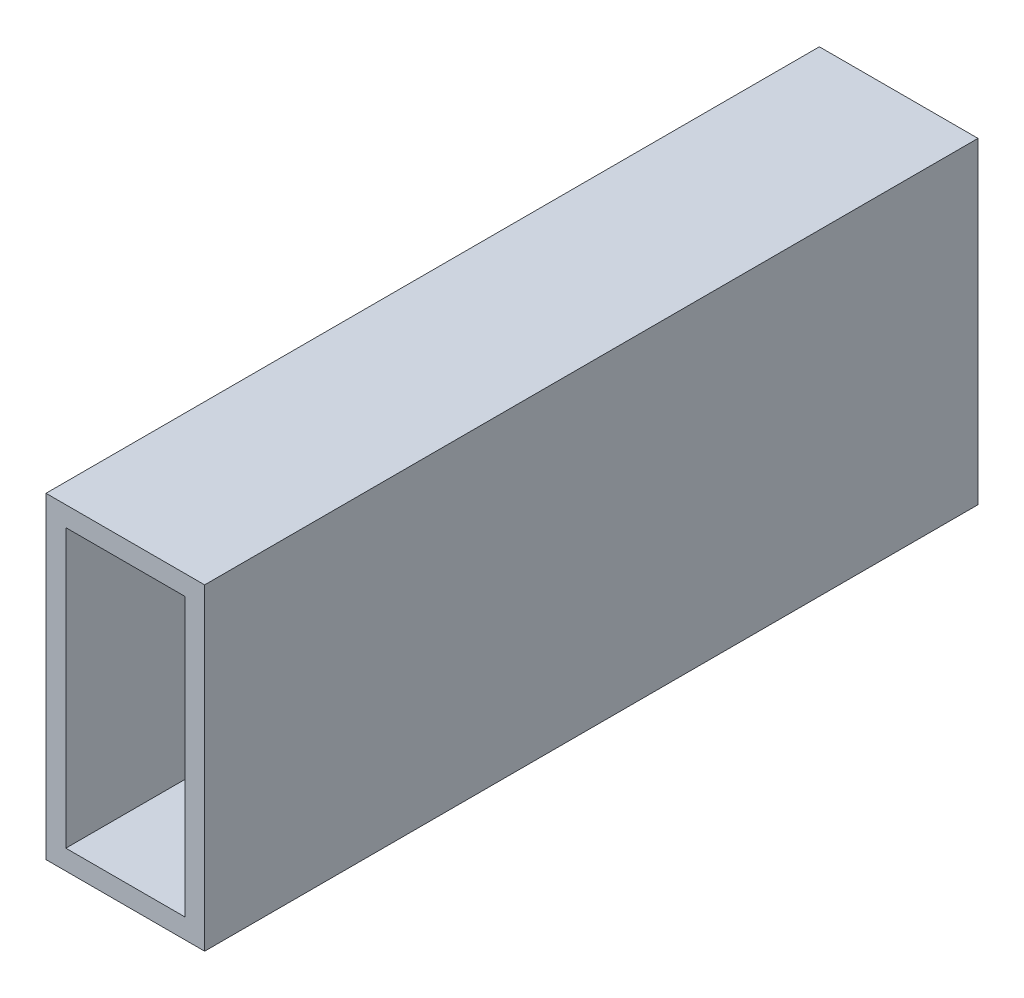
ISO-10303-21;
HEADER;
FILE_DESCRIPTION(('STEP AP214'),'2;1');
FILE_NAME('part.step','',(''),(''),'','','');
FILE_SCHEMA(('AUTOMOTIVE_DESIGN { 1 0 10303 214 1 1 1 1 }'));
ENDSEC;
DATA;
#1=APPLICATION_CONTEXT('core data for automotive mechanical design processes');
#2=APPLICATION_PROTOCOL_DEFINITION('international standard','automotive_design',2000,#1);
#3=PRODUCT_CONTEXT('',#1,'mechanical');
#4=PRODUCT('Part','Part','',(#3));
#5=PRODUCT_RELATED_PRODUCT_CATEGORY('part','',(#4));
#6=PRODUCT_DEFINITION_FORMATION('','',#4);
#7=PRODUCT_DEFINITION_CONTEXT('part definition',#1,'design');
#8=PRODUCT_DEFINITION('design','',#6,#7);
#9=PRODUCT_DEFINITION_SHAPE('','',#8);
#10=(LENGTH_UNIT() NAMED_UNIT(*) SI_UNIT(.MILLI.,.METRE.));
#11=(NAMED_UNIT(*) PLANE_ANGLE_UNIT() SI_UNIT($,.RADIAN.));
#12=(NAMED_UNIT(*) SI_UNIT($,.STERADIAN.) SOLID_ANGLE_UNIT());
#13=UNCERTAINTY_MEASURE_WITH_UNIT(LENGTH_MEASURE(1.E-05),#10,'distance_accuracy_value','');
#14=(GEOMETRIC_REPRESENTATION_CONTEXT(3) GLOBAL_UNCERTAINTY_ASSIGNED_CONTEXT((#13)) GLOBAL_UNIT_ASSIGNED_CONTEXT((#10,
#11,#12)) REPRESENTATION_CONTEXT('',''));
#15=CARTESIAN_POINT('',(0.,0.,0.));
#16=DIRECTION('',(0.,0.,1.));
#17=DIRECTION('',(1.,0.,0.));
#18=AXIS2_PLACEMENT_3D('',#15,#16,#17);
#19=CARTESIAN_POINT('',(0.,0.,61.9125));
#20=DIRECTION('',(0.,0.,-1.));
#21=DIRECTION('',(-1.,0.,0.));
#22=AXIS2_PLACEMENT_3D('',#19,#20,#21);
#23=PLANE('',#22);
#24=DIRECTION('',(0.,1.,0.));
#25=VECTOR('',#24,1.);
#26=CARTESIAN_POINT('',(12.7,-25.4,61.9125));
#27=LINE('',#26,#25);
#28=CARTESIAN_POINT('',(12.7,-25.4,61.9125));
#29=VERTEX_POINT('',#28);
#30=CARTESIAN_POINT('',(12.7,25.4,61.9125));
#31=VERTEX_POINT('',#30);
#32=EDGE_CURVE('E130',#29,#31,#27,.T.);
#33=ORIENTED_EDGE('',*,*,#32,.T.);
#34=DIRECTION('',(-1.,0.,0.));
#35=VECTOR('',#34,1.);
#36=CARTESIAN_POINT('',(-12.7,25.4,61.9125));
#37=LINE('',#36,#35);
#38=CARTESIAN_POINT('',(-12.7,25.4,61.9125));
#39=VERTEX_POINT('',#38);
#40=EDGE_CURVE('E133',#31,#39,#37,.T.);
#41=ORIENTED_EDGE('',*,*,#40,.T.);
#42=DIRECTION('',(0.,-1.,0.));
#43=VECTOR('',#42,1.);
#44=CARTESIAN_POINT('',(-12.7,-25.4,61.9125));
#45=LINE('',#44,#43);
#46=CARTESIAN_POINT('',(-12.7,-25.4,61.9125));
#47=VERTEX_POINT('',#46);
#48=EDGE_CURVE('E136',#39,#47,#45,.T.);
#49=ORIENTED_EDGE('',*,*,#48,.T.);
#50=DIRECTION('',(1.,0.,0.));
#51=VECTOR('',#50,1.);
#52=CARTESIAN_POINT('',(-12.7,-25.4,61.9125));
#53=LINE('',#52,#51);
#54=EDGE_CURVE('E138',#47,#29,#53,.T.);
#55=ORIENTED_EDGE('',*,*,#54,.T.);
#56=EDGE_LOOP('',(#33,#41,#49,#55));
#57=FACE_BOUND('',#56,.T.);
#58=DIRECTION('',(0.,1.,0.));
#59=VECTOR('',#58,1.);
#60=CARTESIAN_POINT('',(9.525,0.,61.9125));
#61=LINE('',#60,#59);
#62=CARTESIAN_POINT('',(9.525,-22.225,61.9125));
#63=VERTEX_POINT('',#62);
#64=CARTESIAN_POINT('',(9.525,22.225,61.9125));
#65=VERTEX_POINT('',#64);
#66=EDGE_CURVE('E118',#63,#65,#61,.T.);
#67=ORIENTED_EDGE('',*,*,#66,.F.);
#68=DIRECTION('',(1.,0.,0.));
#69=VECTOR('',#68,1.);
#70=CARTESIAN_POINT('',(0.,-22.225,61.9125));
#71=LINE('',#70,#69);
#72=CARTESIAN_POINT('',(-9.525,-22.225,61.9125));
#73=VERTEX_POINT('',#72);
#74=EDGE_CURVE('E103',#73,#63,#71,.T.);
#75=ORIENTED_EDGE('',*,*,#74,.F.);
#76=DIRECTION('',(0.,-1.,0.));
#77=VECTOR('',#76,1.);
#78=CARTESIAN_POINT('',(-9.525,0.,61.9125));
#79=LINE('',#78,#77);
#80=CARTESIAN_POINT('',(-9.525,22.225,61.9125));
#81=VERTEX_POINT('',#80);
#82=EDGE_CURVE('E127',#81,#73,#79,.T.);
#83=ORIENTED_EDGE('',*,*,#82,.F.);
#84=DIRECTION('',(-1.,0.,0.));
#85=VECTOR('',#84,1.);
#86=CARTESIAN_POINT('',(0.,22.225,61.9125));
#87=LINE('',#86,#85);
#88=EDGE_CURVE('E120',#65,#81,#87,.T.);
#89=ORIENTED_EDGE('',*,*,#88,.F.);
#90=EDGE_LOOP('',(#67,#75,#83,#89));
#91=FACE_BOUND('',#90,.T.);
#92=ADVANCED_FACE('F33',(#57,#91),#23,.F.);
#93=CARTESIAN_POINT('',(0.,0.,-61.9125));
#94=DIRECTION('',(0.,0.,-1.));
#95=DIRECTION('',(-1.,0.,0.));
#96=AXIS2_PLACEMENT_3D('',#93,#94,#95);
#97=PLANE('',#96);
#98=DIRECTION('',(0.,1.,0.));
#99=VECTOR('',#98,1.);
#100=CARTESIAN_POINT('',(12.7,-25.4,-61.9125));
#101=LINE('',#100,#99);
#102=CARTESIAN_POINT('',(12.7,-25.4,-61.9125));
#103=VERTEX_POINT('',#102);
#104=CARTESIAN_POINT('',(12.7,25.4,-61.9125));
#105=VERTEX_POINT('',#104);
#106=EDGE_CURVE('E141',#103,#105,#101,.T.);
#107=ORIENTED_EDGE('',*,*,#106,.F.);
#108=DIRECTION('',(1.,0.,0.));
#109=VECTOR('',#108,1.);
#110=CARTESIAN_POINT('',(-12.7,-25.4,-61.9125));
#111=LINE('',#110,#109);
#112=CARTESIAN_POINT('',(-12.7,-25.4,-61.9125));
#113=VERTEX_POINT('',#112);
#114=EDGE_CURVE('E134',#113,#103,#111,.T.);
#115=ORIENTED_EDGE('',*,*,#114,.F.);
#116=DIRECTION('',(0.,-1.,0.));
#117=VECTOR('',#116,1.);
#118=CARTESIAN_POINT('',(-12.7,-25.4,-61.9125));
#119=LINE('',#118,#117);
#120=CARTESIAN_POINT('',(-12.7,25.4,-61.9125));
#121=VERTEX_POINT('',#120);
#122=EDGE_CURVE('E146',#121,#113,#119,.T.);
#123=ORIENTED_EDGE('',*,*,#122,.F.);
#124=DIRECTION('',(-1.,0.,0.));
#125=VECTOR('',#124,1.);
#126=CARTESIAN_POINT('',(-12.7,25.4,-61.9125));
#127=LINE('',#126,#125);
#128=EDGE_CURVE('E144',#105,#121,#127,.T.);
#129=ORIENTED_EDGE('',*,*,#128,.F.);
#130=EDGE_LOOP('',(#107,#115,#123,#129));
#131=FACE_BOUND('',#130,.T.);
#132=DIRECTION('',(1.,0.,0.));
#133=VECTOR('',#132,1.);
#134=CARTESIAN_POINT('',(0.,-22.225,-61.9125));
#135=LINE('',#134,#133);
#136=CARTESIAN_POINT('',(-9.525,-22.225,-61.9125));
#137=VERTEX_POINT('',#136);
#138=CARTESIAN_POINT('',(9.525,-22.225,-61.9125));
#139=VERTEX_POINT('',#138);
#140=EDGE_CURVE('E101',#137,#139,#135,.T.);
#141=ORIENTED_EDGE('',*,*,#140,.T.);
#142=DIRECTION('',(0.,1.,0.));
#143=VECTOR('',#142,1.);
#144=CARTESIAN_POINT('',(9.525,0.,-61.9125));
#145=LINE('',#144,#143);
#146=CARTESIAN_POINT('',(9.525,22.225,-61.9125));
#147=VERTEX_POINT('',#146);
#148=EDGE_CURVE('E109',#139,#147,#145,.T.);
#149=ORIENTED_EDGE('',*,*,#148,.T.);
#150=DIRECTION('',(-1.,0.,0.));
#151=VECTOR('',#150,1.);
#152=CARTESIAN_POINT('',(0.,22.225,-61.9125));
#153=LINE('',#152,#151);
#154=CARTESIAN_POINT('',(-9.525,22.225,-61.9125));
#155=VERTEX_POINT('',#154);
#156=EDGE_CURVE('E115',#147,#155,#153,.T.);
#157=ORIENTED_EDGE('',*,*,#156,.T.);
#158=DIRECTION('',(0.,-1.,0.));
#159=VECTOR('',#158,1.);
#160=CARTESIAN_POINT('',(-9.525,0.,-61.9125));
#161=LINE('',#160,#159);
#162=EDGE_CURVE('E55',#155,#137,#161,.T.);
#163=ORIENTED_EDGE('',*,*,#162,.T.);
#164=EDGE_LOOP('',(#141,#149,#157,#163));
#165=FACE_BOUND('',#164,.T.);
#166=ADVANCED_FACE('F117',(#131,#165),#97,.T.);
#167=CARTESIAN_POINT('',(12.7,-25.4,61.9125));
#168=DIRECTION('',(-1.,0.,0.));
#169=DIRECTION('',(0.,0.,1.));
#170=AXIS2_PLACEMENT_3D('',#167,#168,#169);
#171=PLANE('',#170);
#172=ORIENTED_EDGE('',*,*,#106,.T.);
#173=DIRECTION('',(0.,0.,-1.));
#174=VECTOR('',#173,1.);
#175=CARTESIAN_POINT('',(12.7,25.4,61.9125));
#176=LINE('',#175,#174);
#177=EDGE_CURVE('E11',#31,#105,#176,.T.);
#178=ORIENTED_EDGE('',*,*,#177,.F.);
#179=ORIENTED_EDGE('',*,*,#32,.F.);
#180=DIRECTION('',(0.,0.,-1.));
#181=VECTOR('',#180,1.);
#182=CARTESIAN_POINT('',(12.7,-25.4,61.9125));
#183=LINE('',#182,#181);
#184=EDGE_CURVE('E140',#29,#103,#183,.T.);
#185=ORIENTED_EDGE('',*,*,#184,.T.);
#186=EDGE_LOOP('',(#172,#178,#179,#185));
#187=FACE_BOUND('',#186,.T.);
#188=ADVANCED_FACE('F35',(#187),#171,.F.);
#189=CARTESIAN_POINT('',(-12.7,25.4,61.9125));
#190=DIRECTION('',(0.,-1.,0.));
#191=DIRECTION('',(0.,0.,-1.));
#192=AXIS2_PLACEMENT_3D('',#189,#190,#191);
#193=PLANE('',#192);
#194=ORIENTED_EDGE('',*,*,#128,.T.);
#195=DIRECTION('',(0.,0.,-1.));
#196=VECTOR('',#195,1.);
#197=CARTESIAN_POINT('',(-12.7,25.4,61.9125));
#198=LINE('',#197,#196);
#199=EDGE_CURVE('E41',#39,#121,#198,.T.);
#200=ORIENTED_EDGE('',*,*,#199,.F.);
#201=ORIENTED_EDGE('',*,*,#40,.F.);
#202=ORIENTED_EDGE('',*,*,#177,.T.);
#203=EDGE_LOOP('',(#194,#200,#201,#202));
#204=FACE_BOUND('',#203,.T.);
#205=ADVANCED_FACE('F173',(#204),#193,.F.);
#206=CARTESIAN_POINT('',(-12.7,-25.4,61.9125));
#207=DIRECTION('',(1.,0.,0.));
#208=DIRECTION('',(0.,0.,-1.));
#209=AXIS2_PLACEMENT_3D('',#206,#207,#208);
#210=PLANE('',#209);
#211=ORIENTED_EDGE('',*,*,#122,.T.);
#212=DIRECTION('',(0.,0.,-1.));
#213=VECTOR('',#212,1.);
#214=CARTESIAN_POINT('',(-12.7,-25.4,61.9125));
#215=LINE('',#214,#213);
#216=EDGE_CURVE('E151',#47,#113,#215,.T.);
#217=ORIENTED_EDGE('',*,*,#216,.F.);
#218=ORIENTED_EDGE('',*,*,#48,.F.);
#219=ORIENTED_EDGE('',*,*,#199,.T.);
#220=EDGE_LOOP('',(#211,#217,#218,#219));
#221=FACE_BOUND('',#220,.T.);
#222=ADVANCED_FACE('F158',(#221),#210,.F.);
#223=CARTESIAN_POINT('',(-12.7,-25.4,61.9125));
#224=DIRECTION('',(0.,1.,0.));
#225=DIRECTION('',(0.,0.,1.));
#226=AXIS2_PLACEMENT_3D('',#223,#224,#225);
#227=PLANE('',#226);
#228=ORIENTED_EDGE('',*,*,#114,.T.);
#229=ORIENTED_EDGE('',*,*,#184,.F.);
#230=ORIENTED_EDGE('',*,*,#54,.F.);
#231=ORIENTED_EDGE('',*,*,#216,.T.);
#232=EDGE_LOOP('',(#228,#229,#230,#231));
#233=FACE_BOUND('',#232,.T.);
#234=ADVANCED_FACE('F166',(#233),#227,.F.);
#235=CARTESIAN_POINT('',(9.525,-25.4,61.9125));
#236=DIRECTION('',(-1.,0.,0.));
#237=DIRECTION('',(0.,0.,1.));
#238=AXIS2_PLACEMENT_3D('',#235,#236,#237);
#239=PLANE('',#238);
#240=ORIENTED_EDGE('',*,*,#148,.F.);
#241=DIRECTION('',(0.,0.,-1.));
#242=VECTOR('',#241,1.);
#243=CARTESIAN_POINT('',(9.525,-22.225,61.9125));
#244=LINE('',#243,#242);
#245=EDGE_CURVE('E97',#63,#139,#244,.T.);
#246=ORIENTED_EDGE('',*,*,#245,.F.);
#247=ORIENTED_EDGE('',*,*,#66,.T.);
#248=DIRECTION('',(0.,0.,-1.));
#249=VECTOR('',#248,1.);
#250=CARTESIAN_POINT('',(9.525,22.225,61.9125));
#251=LINE('',#250,#249);
#252=EDGE_CURVE('E112',#65,#147,#251,.T.);
#253=ORIENTED_EDGE('',*,*,#252,.T.);
#254=EDGE_LOOP('',(#240,#246,#247,#253));
#255=FACE_BOUND('',#254,.T.);
#256=ADVANCED_FACE('F110',(#255),#239,.T.);
#257=CARTESIAN_POINT('',(-12.7,22.225,61.9125));
#258=DIRECTION('',(0.,-1.,0.));
#259=DIRECTION('',(0.,0.,-1.));
#260=AXIS2_PLACEMENT_3D('',#257,#258,#259);
#261=PLANE('',#260);
#262=ORIENTED_EDGE('',*,*,#156,.F.);
#263=ORIENTED_EDGE('',*,*,#252,.F.);
#264=ORIENTED_EDGE('',*,*,#88,.T.);
#265=DIRECTION('',(0.,0.,-1.));
#266=VECTOR('',#265,1.);
#267=CARTESIAN_POINT('',(-9.525,22.225,61.9125));
#268=LINE('',#267,#266);
#269=EDGE_CURVE('E256',#81,#155,#268,.T.);
#270=ORIENTED_EDGE('',*,*,#269,.T.);
#271=EDGE_LOOP('',(#262,#263,#264,#270));
#272=FACE_BOUND('',#271,.T.);
#273=ADVANCED_FACE('F193',(#272),#261,.T.);
#274=CARTESIAN_POINT('',(-9.525,-25.4,61.9125));
#275=DIRECTION('',(1.,0.,0.));
#276=DIRECTION('',(0.,0.,-1.));
#277=AXIS2_PLACEMENT_3D('',#274,#275,#276);
#278=PLANE('',#277);
#279=ORIENTED_EDGE('',*,*,#162,.F.);
#280=ORIENTED_EDGE('',*,*,#269,.F.);
#281=ORIENTED_EDGE('',*,*,#82,.T.);
#282=DIRECTION('',(0.,0.,-1.));
#283=VECTOR('',#282,1.);
#284=CARTESIAN_POINT('',(-9.525,-22.225,61.9125));
#285=LINE('',#284,#283);
#286=EDGE_CURVE('E48',#73,#137,#285,.T.);
#287=ORIENTED_EDGE('',*,*,#286,.T.);
#288=EDGE_LOOP('',(#279,#280,#281,#287));
#289=FACE_BOUND('',#288,.T.);
#290=ADVANCED_FACE('F198',(#289),#278,.T.);
#291=CARTESIAN_POINT('',(-12.7,-22.225,61.9125));
#292=DIRECTION('',(0.,1.,0.));
#293=DIRECTION('',(0.,0.,1.));
#294=AXIS2_PLACEMENT_3D('',#291,#292,#293);
#295=PLANE('',#294);
#296=ORIENTED_EDGE('',*,*,#140,.F.);
#297=ORIENTED_EDGE('',*,*,#286,.F.);
#298=ORIENTED_EDGE('',*,*,#74,.T.);
#299=ORIENTED_EDGE('',*,*,#245,.T.);
#300=EDGE_LOOP('',(#296,#297,#298,#299));
#301=FACE_BOUND('',#300,.T.);
#302=ADVANCED_FACE('F99',(#301),#295,.T.);
#303=CLOSED_SHELL('',(#92,#166,#188,#205,#222,#234,#256,#273,#290,#302));
#304=MANIFOLD_SOLID_BREP('B2',#303);
#305=ADVANCED_BREP_SHAPE_REPRESENTATION('',(#18,#304),#14);
#306=SHAPE_DEFINITION_REPRESENTATION(#9,#305);
ENDSEC;
END-ISO-10303-21;
